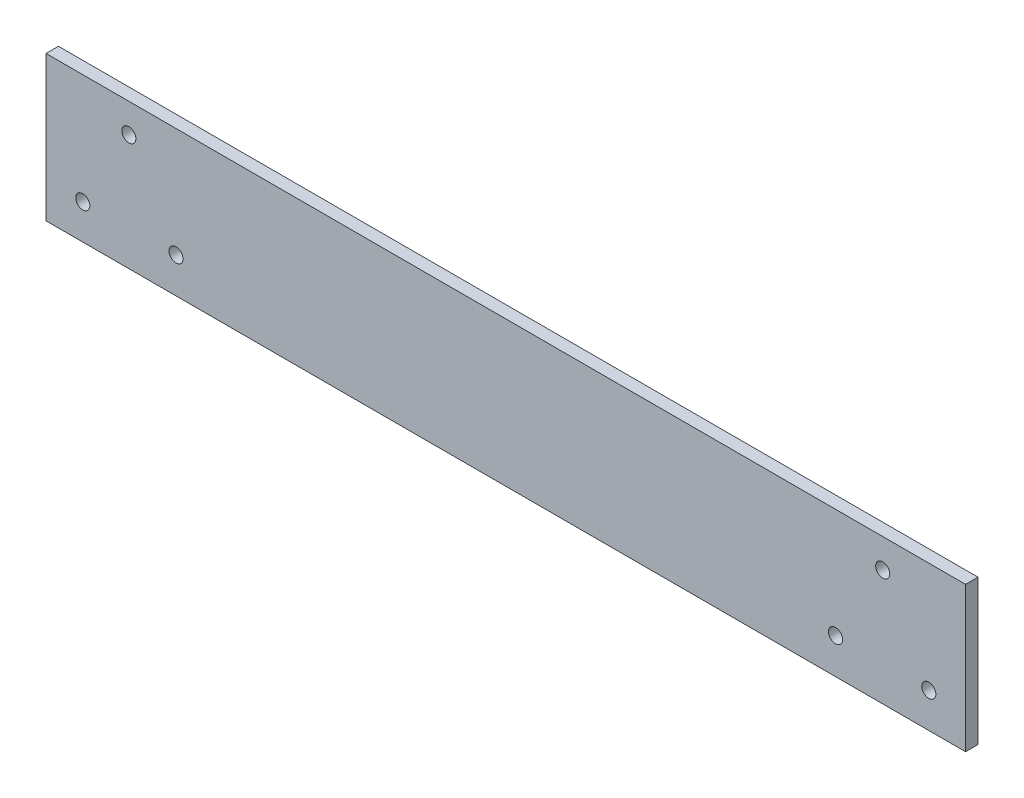
ISO-10303-21;
HEADER;
FILE_DESCRIPTION(('STEP AP214'),'2;1');
FILE_NAME('part.step','',(''),(''),'','','');
FILE_SCHEMA(('AUTOMOTIVE_DESIGN { 1 0 10303 214 1 1 1 1 }'));
ENDSEC;
DATA;
#1=APPLICATION_CONTEXT('core data for automotive mechanical design processes');
#2=APPLICATION_PROTOCOL_DEFINITION('international standard','automotive_design',2000,#1);
#3=PRODUCT_CONTEXT('',#1,'mechanical');
#4=PRODUCT('Part','Part','',(#3));
#5=PRODUCT_RELATED_PRODUCT_CATEGORY('part','',(#4));
#6=PRODUCT_DEFINITION_FORMATION('','',#4);
#7=PRODUCT_DEFINITION_CONTEXT('part definition',#1,'design');
#8=PRODUCT_DEFINITION('design','',#6,#7);
#9=PRODUCT_DEFINITION_SHAPE('','',#8);
#10=(LENGTH_UNIT() NAMED_UNIT(*) SI_UNIT(.MILLI.,.METRE.));
#11=(NAMED_UNIT(*) PLANE_ANGLE_UNIT() SI_UNIT($,.RADIAN.));
#12=(NAMED_UNIT(*) SI_UNIT($,.STERADIAN.) SOLID_ANGLE_UNIT());
#13=UNCERTAINTY_MEASURE_WITH_UNIT(LENGTH_MEASURE(1.E-05),#10,'distance_accuracy_value','');
#14=(GEOMETRIC_REPRESENTATION_CONTEXT(3) GLOBAL_UNCERTAINTY_ASSIGNED_CONTEXT((#13)) GLOBAL_UNIT_ASSIGNED_CONTEXT((#10,
#11,#12)) REPRESENTATION_CONTEXT('',''));
#15=CARTESIAN_POINT('',(0.,0.,0.));
#16=DIRECTION('',(0.,0.,1.));
#17=DIRECTION('',(1.,0.,0.));
#18=AXIS2_PLACEMENT_3D('',#15,#16,#17);
#19=CARTESIAN_POINT('',(-55.3770895836406,-24.3041714285714,3.));
#20=DIRECTION('',(0.,0.,1.));
#21=DIRECTION('',(1.,0.,0.));
#22=AXIS2_PLACEMENT_3D('',#19,#20,#21);
#23=PLANE('',#22);
#24=CARTESIAN_POINT('',(146.622910416359,3.69582857142859,3.));
#25=DIRECTION('',(0.,0.,1.));
#26=DIRECTION('',(-1.,0.,0.));
#27=AXIS2_PLACEMENT_3D('',#24,#25,#26);
#28=CIRCLE('',#27,1.70000000000004);
#29=CARTESIAN_POINT('',(144.922910416359,3.69582857142859,3.));
#30=VERTEX_POINT('',#29);
#31=EDGE_CURVE('E133',#30,#30,#28,.T.);
#32=ORIENTED_EDGE('',*,*,#31,.F.);
#33=EDGE_LOOP('',(#32));
#34=FACE_BOUND('',#33,.T.);
#35=CARTESIAN_POINT('',(-23.9784029809601,-15.7231366501057,3.));
#36=DIRECTION('',(0.,0.,1.));
#37=DIRECTION('',(1.,0.,0.));
#38=AXIS2_PLACEMENT_3D('',#35,#36,#37);
#39=CIRCLE('',#38,1.69999999999999);
#40=CARTESIAN_POINT('',(-22.2784029809601,-15.7231366501057,3.));
#41=VERTEX_POINT('',#40);
#42=EDGE_CURVE('E121',#41,#41,#39,.T.);
#43=ORIENTED_EDGE('',*,*,#42,.F.);
#44=EDGE_LOOP('',(#43));
#45=FACE_BOUND('',#44,.T.);
#46=CARTESIAN_POINT('',(-35.3770895836406,3.69582857142859,3.));
#47=DIRECTION('',(0.,0.,1.));
#48=DIRECTION('',(1.,0.,0.));
#49=AXIS2_PLACEMENT_3D('',#46,#47,#48);
#50=CIRCLE('',#49,1.70000000000001);
#51=CARTESIAN_POINT('',(-33.6770895836405,3.69582857142859,3.));
#52=VERTEX_POINT('',#51);
#53=EDGE_CURVE('E100',#52,#52,#50,.T.);
#54=ORIENTED_EDGE('',*,*,#53,.F.);
#55=EDGE_LOOP('',(#54));
#56=FACE_BOUND('',#55,.T.);
#57=DIRECTION('',(0.,-1.,0.));
#58=VECTOR('',#57,1.);
#59=CARTESIAN_POINT('',(-55.3770895836406,10.6958285714286,3.));
#60=LINE('',#59,#58);
#61=CARTESIAN_POINT('',(-55.3770895836406,10.6958285714286,3.));
#62=VERTEX_POINT('',#61);
#63=CARTESIAN_POINT('',(-55.3770895836406,-24.3041714285714,3.));
#64=VERTEX_POINT('',#63);
#65=EDGE_CURVE('E85',#62,#64,#60,.T.);
#66=ORIENTED_EDGE('',*,*,#65,.T.);
#67=DIRECTION('',(1.,0.,0.));
#68=VECTOR('',#67,1.);
#69=CARTESIAN_POINT('',(-55.3770895836406,-24.3041714285714,3.));
#70=LINE('',#69,#68);
#71=CARTESIAN_POINT('',(166.622910416359,-24.3041714285714,3.));
#72=VERTEX_POINT('',#71);
#73=EDGE_CURVE('E80',#64,#72,#70,.T.);
#74=ORIENTED_EDGE('',*,*,#73,.T.);
#75=DIRECTION('',(0.,1.,0.));
#76=VECTOR('',#75,1.);
#77=CARTESIAN_POINT('',(166.622910416359,10.6958285714286,3.));
#78=LINE('',#77,#76);
#79=CARTESIAN_POINT('',(166.622910416359,10.6958285714286,3.));
#80=VERTEX_POINT('',#79);
#81=EDGE_CURVE('E83',#72,#80,#78,.T.);
#82=ORIENTED_EDGE('',*,*,#81,.T.);
#83=DIRECTION('',(-1.,0.,0.));
#84=VECTOR('',#83,1.);
#85=CARTESIAN_POINT('',(-55.3770895836406,10.6958285714286,3.));
#86=LINE('',#85,#84);
#87=EDGE_CURVE('E50',#80,#62,#86,.T.);
#88=ORIENTED_EDGE('',*,*,#87,.T.);
#89=EDGE_LOOP('',(#66,#74,#82,#88));
#90=FACE_BOUND('',#89,.T.);
#91=CARTESIAN_POINT('',(135.224223813679,-15.7231366501057,3.));
#92=DIRECTION('',(0.,0.,1.));
#93=DIRECTION('',(-1.,0.,0.));
#94=AXIS2_PLACEMENT_3D('',#91,#92,#93);
#95=CIRCLE('',#94,1.70000000000001);
#96=CARTESIAN_POINT('',(133.524223813679,-15.7231366501057,3.));
#97=VERTEX_POINT('',#96);
#98=EDGE_CURVE('E115',#97,#97,#95,.T.);
#99=ORIENTED_EDGE('',*,*,#98,.F.);
#100=EDGE_LOOP('',(#99));
#101=FACE_BOUND('',#100,.T.);
#102=CARTESIAN_POINT('',(157.740884312074,-15.8852062070371,3.));
#103=DIRECTION('',(0.,0.,1.));
#104=DIRECTION('',(-1.,0.,0.));
#105=AXIS2_PLACEMENT_3D('',#102,#103,#104);
#106=CIRCLE('',#105,1.70000000000002);
#107=CARTESIAN_POINT('',(156.040884312074,-15.8852062070371,3.));
#108=VERTEX_POINT('',#107);
#109=EDGE_CURVE('E127',#108,#108,#106,.T.);
#110=ORIENTED_EDGE('',*,*,#109,.F.);
#111=EDGE_LOOP('',(#110));
#112=FACE_BOUND('',#111,.T.);
#113=CARTESIAN_POINT('',(-46.4950634793555,-15.8852062070371,3.));
#114=DIRECTION('',(0.,0.,1.));
#115=DIRECTION('',(1.,0.,0.));
#116=AXIS2_PLACEMENT_3D('',#113,#114,#115);
#117=CIRCLE('',#116,1.69999999999999);
#118=CARTESIAN_POINT('',(-44.7950634793555,-15.8852062070371,3.));
#119=VERTEX_POINT('',#118);
#120=EDGE_CURVE('E139',#119,#119,#117,.T.);
#121=ORIENTED_EDGE('',*,*,#120,.F.);
#122=EDGE_LOOP('',(#121));
#123=FACE_BOUND('',#122,.T.);
#124=ADVANCED_FACE('F33',(#34,#45,#56,#90,#101,#112,#123),#23,.T.);
#125=CARTESIAN_POINT('',(-55.3770895836406,-24.3041714285714,0.));
#126=DIRECTION('',(0.,0.,1.));
#127=DIRECTION('',(1.,0.,0.));
#128=AXIS2_PLACEMENT_3D('',#125,#126,#127);
#129=PLANE('',#128);
#130=CARTESIAN_POINT('',(146.622910416359,3.69582857142859,0.));
#131=DIRECTION('',(0.,0.,1.));
#132=DIRECTION('',(-1.,0.,0.));
#133=AXIS2_PLACEMENT_3D('',#130,#131,#132);
#134=CIRCLE('',#133,1.70000000000004);
#135=CARTESIAN_POINT('',(144.922910416359,3.69582857142859,0.));
#136=VERTEX_POINT('',#135);
#137=EDGE_CURVE('E136',#136,#136,#134,.T.);
#138=ORIENTED_EDGE('',*,*,#137,.T.);
#139=EDGE_LOOP('',(#138));
#140=FACE_BOUND('',#139,.T.);
#141=CARTESIAN_POINT('',(-23.9784029809601,-15.7231366501057,0.));
#142=DIRECTION('',(0.,0.,1.));
#143=DIRECTION('',(1.,0.,0.));
#144=AXIS2_PLACEMENT_3D('',#141,#142,#143);
#145=CIRCLE('',#144,1.69999999999999);
#146=CARTESIAN_POINT('',(-22.2784029809601,-15.7231366501057,0.));
#147=VERTEX_POINT('',#146);
#148=EDGE_CURVE('E124',#147,#147,#145,.T.);
#149=ORIENTED_EDGE('',*,*,#148,.T.);
#150=EDGE_LOOP('',(#149));
#151=FACE_BOUND('',#150,.T.);
#152=CARTESIAN_POINT('',(-35.3770895836406,3.69582857142859,0.));
#153=DIRECTION('',(0.,0.,1.));
#154=DIRECTION('',(1.,0.,0.));
#155=AXIS2_PLACEMENT_3D('',#152,#153,#154);
#156=CIRCLE('',#155,1.70000000000001);
#157=CARTESIAN_POINT('',(-33.6770895836405,3.69582857142859,0.));
#158=VERTEX_POINT('',#157);
#159=EDGE_CURVE('E112',#158,#158,#156,.T.);
#160=ORIENTED_EDGE('',*,*,#159,.T.);
#161=EDGE_LOOP('',(#160));
#162=FACE_BOUND('',#161,.T.);
#163=DIRECTION('',(0.,-1.,0.));
#164=VECTOR('',#163,1.);
#165=CARTESIAN_POINT('',(-55.3770895836406,10.6958285714286,0.));
#166=LINE('',#165,#164);
#167=CARTESIAN_POINT('',(-55.3770895836406,10.6958285714286,0.));
#168=VERTEX_POINT('',#167);
#169=CARTESIAN_POINT('',(-55.3770895836406,-24.3041714285714,0.));
#170=VERTEX_POINT('',#169);
#171=EDGE_CURVE('E97',#168,#170,#166,.T.);
#172=ORIENTED_EDGE('',*,*,#171,.F.);
#173=DIRECTION('',(-1.,0.,0.));
#174=VECTOR('',#173,1.);
#175=CARTESIAN_POINT('',(-55.3770895836406,10.6958285714286,0.));
#176=LINE('',#175,#174);
#177=CARTESIAN_POINT('',(166.622910416359,10.6958285714286,0.));
#178=VERTEX_POINT('',#177);
#179=EDGE_CURVE('E73',#178,#168,#176,.T.);
#180=ORIENTED_EDGE('',*,*,#179,.F.);
#181=DIRECTION('',(0.,1.,0.));
#182=VECTOR('',#181,1.);
#183=CARTESIAN_POINT('',(166.622910416359,10.6958285714286,0.));
#184=LINE('',#183,#182);
#185=CARTESIAN_POINT('',(166.622910416359,-24.3041714285714,0.));
#186=VERTEX_POINT('',#185);
#187=EDGE_CURVE('E67',#186,#178,#184,.T.);
#188=ORIENTED_EDGE('',*,*,#187,.F.);
#189=DIRECTION('',(1.,0.,0.));
#190=VECTOR('',#189,1.);
#191=CARTESIAN_POINT('',(-55.3770895836406,-24.3041714285714,0.));
#192=LINE('',#191,#190);
#193=EDGE_CURVE('E89',#170,#186,#192,.T.);
#194=ORIENTED_EDGE('',*,*,#193,.F.);
#195=EDGE_LOOP('',(#172,#180,#188,#194));
#196=FACE_BOUND('',#195,.T.);
#197=CARTESIAN_POINT('',(135.224223813679,-15.7231366501057,0.));
#198=DIRECTION('',(0.,0.,1.));
#199=DIRECTION('',(-1.,0.,0.));
#200=AXIS2_PLACEMENT_3D('',#197,#198,#199);
#201=CIRCLE('',#200,1.70000000000001);
#202=CARTESIAN_POINT('',(133.524223813679,-15.7231366501057,0.));
#203=VERTEX_POINT('',#202);
#204=EDGE_CURVE('E118',#203,#203,#201,.T.);
#205=ORIENTED_EDGE('',*,*,#204,.T.);
#206=EDGE_LOOP('',(#205));
#207=FACE_BOUND('',#206,.T.);
#208=CARTESIAN_POINT('',(157.740884312074,-15.8852062070371,0.));
#209=DIRECTION('',(0.,0.,1.));
#210=DIRECTION('',(-1.,0.,0.));
#211=AXIS2_PLACEMENT_3D('',#208,#209,#210);
#212=CIRCLE('',#211,1.70000000000002);
#213=CARTESIAN_POINT('',(156.040884312074,-15.8852062070371,0.));
#214=VERTEX_POINT('',#213);
#215=EDGE_CURVE('E130',#214,#214,#212,.T.);
#216=ORIENTED_EDGE('',*,*,#215,.T.);
#217=EDGE_LOOP('',(#216));
#218=FACE_BOUND('',#217,.T.);
#219=CARTESIAN_POINT('',(-46.4950634793555,-15.8852062070371,0.));
#220=DIRECTION('',(0.,0.,1.));
#221=DIRECTION('',(1.,0.,0.));
#222=AXIS2_PLACEMENT_3D('',#219,#220,#221);
#223=CIRCLE('',#222,1.69999999999999);
#224=CARTESIAN_POINT('',(-44.7950634793555,-15.8852062070371,0.));
#225=VERTEX_POINT('',#224);
#226=EDGE_CURVE('E142',#225,#225,#223,.T.);
#227=ORIENTED_EDGE('',*,*,#226,.T.);
#228=EDGE_LOOP('',(#227));
#229=FACE_BOUND('',#228,.T.);
#230=ADVANCED_FACE('F108',(#140,#151,#162,#196,#207,#218,#229),#129,.F.);
#231=CARTESIAN_POINT('',(-55.3770895836406,10.6958285714286,3.));
#232=DIRECTION('',(1.,0.,0.));
#233=DIRECTION('',(0.,0.,-1.));
#234=AXIS2_PLACEMENT_3D('',#231,#232,#233);
#235=PLANE('',#234);
#236=ORIENTED_EDGE('',*,*,#171,.T.);
#237=DIRECTION('',(0.,0.,-1.));
#238=VECTOR('',#237,1.);
#239=CARTESIAN_POINT('',(-55.3770895836406,-24.3041714285714,3.));
#240=LINE('',#239,#238);
#241=EDGE_CURVE('E11',#64,#170,#240,.T.);
#242=ORIENTED_EDGE('',*,*,#241,.F.);
#243=ORIENTED_EDGE('',*,*,#65,.F.);
#244=DIRECTION('',(0.,0.,-1.));
#245=VECTOR('',#244,1.);
#246=CARTESIAN_POINT('',(-55.3770895836406,10.6958285714286,3.));
#247=LINE('',#246,#245);
#248=EDGE_CURVE('E93',#62,#168,#247,.T.);
#249=ORIENTED_EDGE('',*,*,#248,.T.);
#250=EDGE_LOOP('',(#236,#242,#243,#249));
#251=FACE_BOUND('',#250,.T.);
#252=ADVANCED_FACE('F35',(#251),#235,.F.);
#253=CARTESIAN_POINT('',(-55.3770895836406,-24.3041714285714,3.));
#254=DIRECTION('',(0.,1.,0.));
#255=DIRECTION('',(0.,0.,1.));
#256=AXIS2_PLACEMENT_3D('',#253,#254,#255);
#257=PLANE('',#256);
#258=ORIENTED_EDGE('',*,*,#193,.T.);
#259=DIRECTION('',(0.,0.,-1.));
#260=VECTOR('',#259,1.);
#261=CARTESIAN_POINT('',(166.622910416359,-24.3041714285714,3.));
#262=LINE('',#261,#260);
#263=EDGE_CURVE('E42',#72,#186,#262,.T.);
#264=ORIENTED_EDGE('',*,*,#263,.F.);
#265=ORIENTED_EDGE('',*,*,#73,.F.);
#266=ORIENTED_EDGE('',*,*,#241,.T.);
#267=EDGE_LOOP('',(#258,#264,#265,#266));
#268=FACE_BOUND('',#267,.T.);
#269=ADVANCED_FACE('F88',(#268),#257,.F.);
#270=CARTESIAN_POINT('',(166.622910416359,10.6958285714286,3.));
#271=DIRECTION('',(-1.,0.,0.));
#272=DIRECTION('',(0.,0.,1.));
#273=AXIS2_PLACEMENT_3D('',#270,#271,#272);
#274=PLANE('',#273);
#275=ORIENTED_EDGE('',*,*,#187,.T.);
#276=DIRECTION('',(0.,0.,-1.));
#277=VECTOR('',#276,1.);
#278=CARTESIAN_POINT('',(166.622910416359,10.6958285714286,3.));
#279=LINE('',#278,#277);
#280=EDGE_CURVE('E90',#80,#178,#279,.T.);
#281=ORIENTED_EDGE('',*,*,#280,.F.);
#282=ORIENTED_EDGE('',*,*,#81,.F.);
#283=ORIENTED_EDGE('',*,*,#263,.T.);
#284=EDGE_LOOP('',(#275,#281,#282,#283));
#285=FACE_BOUND('',#284,.T.);
#286=ADVANCED_FACE('F91',(#285),#274,.F.);
#287=CARTESIAN_POINT('',(-55.3770895836406,10.6958285714286,3.));
#288=DIRECTION('',(0.,-1.,0.));
#289=DIRECTION('',(0.,0.,-1.));
#290=AXIS2_PLACEMENT_3D('',#287,#288,#289);
#291=PLANE('',#290);
#292=ORIENTED_EDGE('',*,*,#179,.T.);
#293=ORIENTED_EDGE('',*,*,#248,.F.);
#294=ORIENTED_EDGE('',*,*,#87,.F.);
#295=ORIENTED_EDGE('',*,*,#280,.T.);
#296=EDGE_LOOP('',(#292,#293,#294,#295));
#297=FACE_BOUND('',#296,.T.);
#298=ADVANCED_FACE('F105',(#297),#291,.F.);
#299=CARTESIAN_POINT('',(-35.3770895836406,3.69582857142859,3.));
#300=DIRECTION('',(0.,0.,-1.));
#301=DIRECTION('',(-1.,0.,0.));
#302=AXIS2_PLACEMENT_3D('',#299,#300,#301);
#303=CYLINDRICAL_SURFACE('',#302,1.70000000000001);
#304=ORIENTED_EDGE('',*,*,#53,.T.);
#305=EDGE_LOOP('',(#304));
#306=FACE_BOUND('',#305,.T.);
#307=ORIENTED_EDGE('',*,*,#159,.F.);
#308=EDGE_LOOP('',(#307));
#309=FACE_BOUND('',#308,.T.);
#310=ADVANCED_FACE('F162',(#306,#309),#303,.F.);
#311=CARTESIAN_POINT('',(135.224223813679,-15.7231366501057,3.));
#312=DIRECTION('',(0.,0.,-1.));
#313=DIRECTION('',(-1.,0.,0.));
#314=AXIS2_PLACEMENT_3D('',#311,#312,#313);
#315=CYLINDRICAL_SURFACE('',#314,1.70000000000001);
#316=ORIENTED_EDGE('',*,*,#98,.T.);
#317=EDGE_LOOP('',(#316));
#318=FACE_BOUND('',#317,.T.);
#319=ORIENTED_EDGE('',*,*,#204,.F.);
#320=EDGE_LOOP('',(#319));
#321=FACE_BOUND('',#320,.T.);
#322=ADVANCED_FACE('F210',(#318,#321),#315,.F.);
#323=CARTESIAN_POINT('',(-23.9784029809601,-15.7231366501057,3.));
#324=DIRECTION('',(0.,0.,-1.));
#325=DIRECTION('',(-1.,0.,0.));
#326=AXIS2_PLACEMENT_3D('',#323,#324,#325);
#327=CYLINDRICAL_SURFACE('',#326,1.69999999999999);
#328=ORIENTED_EDGE('',*,*,#42,.T.);
#329=EDGE_LOOP('',(#328));
#330=FACE_BOUND('',#329,.T.);
#331=ORIENTED_EDGE('',*,*,#148,.F.);
#332=EDGE_LOOP('',(#331));
#333=FACE_BOUND('',#332,.T.);
#334=ADVANCED_FACE('F218',(#330,#333),#327,.F.);
#335=CARTESIAN_POINT('',(157.740884312074,-15.8852062070371,3.));
#336=DIRECTION('',(0.,0.,-1.));
#337=DIRECTION('',(-1.,0.,0.));
#338=AXIS2_PLACEMENT_3D('',#335,#336,#337);
#339=CYLINDRICAL_SURFACE('',#338,1.70000000000002);
#340=ORIENTED_EDGE('',*,*,#109,.T.);
#341=EDGE_LOOP('',(#340));
#342=FACE_BOUND('',#341,.T.);
#343=ORIENTED_EDGE('',*,*,#215,.F.);
#344=EDGE_LOOP('',(#343));
#345=FACE_BOUND('',#344,.T.);
#346=ADVANCED_FACE('F226',(#342,#345),#339,.F.);
#347=CARTESIAN_POINT('',(146.622910416359,3.69582857142859,3.));
#348=DIRECTION('',(0.,0.,-1.));
#349=DIRECTION('',(-1.,0.,0.));
#350=AXIS2_PLACEMENT_3D('',#347,#348,#349);
#351=CYLINDRICAL_SURFACE('',#350,1.70000000000004);
#352=ORIENTED_EDGE('',*,*,#31,.T.);
#353=EDGE_LOOP('',(#352));
#354=FACE_BOUND('',#353,.T.);
#355=ORIENTED_EDGE('',*,*,#137,.F.);
#356=EDGE_LOOP('',(#355));
#357=FACE_BOUND('',#356,.T.);
#358=ADVANCED_FACE('F235',(#354,#357),#351,.F.);
#359=CARTESIAN_POINT('',(-46.4950634793555,-15.8852062070371,3.));
#360=DIRECTION('',(0.,0.,-1.));
#361=DIRECTION('',(-1.,0.,0.));
#362=AXIS2_PLACEMENT_3D('',#359,#360,#361);
#363=CYLINDRICAL_SURFACE('',#362,1.69999999999999);
#364=ORIENTED_EDGE('',*,*,#120,.T.);
#365=EDGE_LOOP('',(#364));
#366=FACE_BOUND('',#365,.T.);
#367=ORIENTED_EDGE('',*,*,#226,.F.);
#368=EDGE_LOOP('',(#367));
#369=FACE_BOUND('',#368,.T.);
#370=ADVANCED_FACE('F148',(#366,#369),#363,.F.);
#371=CLOSED_SHELL('',(#124,#230,#252,#269,#286,#298,#310,#322,#334,#346,#358,#370));
#372=MANIFOLD_SOLID_BREP('B2',#371);
#373=ADVANCED_BREP_SHAPE_REPRESENTATION('',(#18,#372),#14);
#374=SHAPE_DEFINITION_REPRESENTATION(#9,#373);
ENDSEC;
END-ISO-10303-21;
